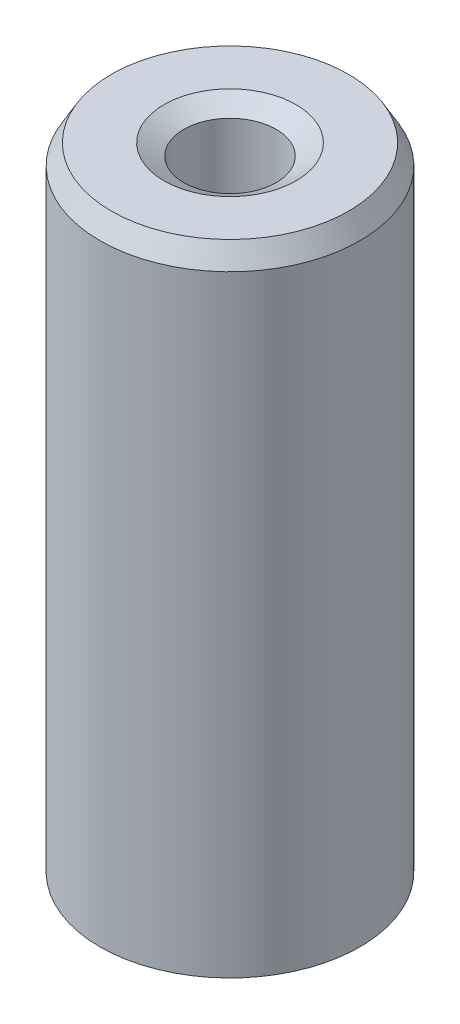
ISO-10303-21;
HEADER;
FILE_DESCRIPTION(('STEP AP214'),'2;1');
FILE_NAME('part.step','',(''),(''),'','','');
FILE_SCHEMA(('AUTOMOTIVE_DESIGN { 1 0 10303 214 1 1 1 1 }'));
ENDSEC;
DATA;
#1=APPLICATION_CONTEXT('core data for automotive mechanical design processes');
#2=APPLICATION_PROTOCOL_DEFINITION('international standard','automotive_design',2000,#1);
#3=PRODUCT_CONTEXT('',#1,'mechanical');
#4=PRODUCT('Part','Part','',(#3));
#5=PRODUCT_RELATED_PRODUCT_CATEGORY('part','',(#4));
#6=PRODUCT_DEFINITION_FORMATION('','',#4);
#7=PRODUCT_DEFINITION_CONTEXT('part definition',#1,'design');
#8=PRODUCT_DEFINITION('design','',#6,#7);
#9=PRODUCT_DEFINITION_SHAPE('','',#8);
#10=(LENGTH_UNIT() NAMED_UNIT(*) SI_UNIT(.MILLI.,.METRE.));
#11=(NAMED_UNIT(*) PLANE_ANGLE_UNIT() SI_UNIT($,.RADIAN.));
#12=(NAMED_UNIT(*) SI_UNIT($,.STERADIAN.) SOLID_ANGLE_UNIT());
#13=UNCERTAINTY_MEASURE_WITH_UNIT(LENGTH_MEASURE(1.E-05),#10,'distance_accuracy_value','');
#14=(GEOMETRIC_REPRESENTATION_CONTEXT(3) GLOBAL_UNCERTAINTY_ASSIGNED_CONTEXT((#13)) GLOBAL_UNIT_ASSIGNED_CONTEXT((#10,
#11,#12)) REPRESENTATION_CONTEXT('',''));
#15=CARTESIAN_POINT('',(0.,0.,0.));
#16=DIRECTION('',(0.,0.,1.));
#17=DIRECTION('',(1.,0.,0.));
#18=AXIS2_PLACEMENT_3D('',#15,#16,#17);
#19=CARTESIAN_POINT('',(0.,61.8129175879378,0.));
#20=DIRECTION('',(0.,-1.,0.));
#21=DIRECTION('',(0.,0.,-1.));
#22=AXIS2_PLACEMENT_3D('',#19,#20,#21);
#23=CYLINDRICAL_SURFACE('',#22,12.5);
#24=CARTESIAN_POINT('',(0.,1.10217291135548,0.));
#25=DIRECTION('',(0.,1.,0.));
#26=DIRECTION('',(0.,0.,1.));
#27=AXIS2_PLACEMENT_3D('',#24,#25,#26);
#28=CIRCLE('',#27,12.5);
#29=CARTESIAN_POINT('',(0.,1.10217291135548,12.5));
#30=VERTEX_POINT('',#29);
#31=EDGE_CURVE('E10',#30,#30,#28,.T.);
#32=ORIENTED_EDGE('',*,*,#31,.T.);
#33=EDGE_LOOP('',(#32));
#34=FACE_BOUND('',#33,.T.);
#35=CARTESIAN_POINT('',(0.,59.9044467498225,0.));
#36=DIRECTION('',(0.,1.,0.));
#37=DIRECTION('',(0.,0.,1.));
#38=AXIS2_PLACEMENT_3D('',#35,#36,#37);
#39=CIRCLE('',#38,12.5);
#40=CARTESIAN_POINT('',(0.,59.9044467498225,12.5));
#41=VERTEX_POINT('',#40);
#42=EDGE_CURVE('E50',#41,#41,#39,.F.);
#43=ORIENTED_EDGE('',*,*,#42,.T.);
#44=EDGE_LOOP('',(#43));
#45=FACE_BOUND('',#44,.T.);
#46=ADVANCED_FACE('F39',(#34,#45),#23,.T.);
#47=CARTESIAN_POINT('',(0.,61.8129175879378,0.));
#48=DIRECTION('',(0.,1.,0.));
#49=DIRECTION('',(0.,0.,1.));
#50=AXIS2_PLACEMENT_3D('',#47,#48,#49);
#51=PLANE('',#50);
#52=CARTESIAN_POINT('',(0.,61.8129175879378,0.));
#53=DIRECTION('',(0.,1.,0.));
#54=DIRECTION('',(0.,0.,1.));
#55=AXIS2_PLACEMENT_3D('',#52,#53,#54);
#56=CIRCLE('',#55,6.34905784751202);
#57=CARTESIAN_POINT('',(0.,61.8129175879378,6.34905784751202));
#58=VERTEX_POINT('',#57);
#59=EDGE_CURVE('E58',#58,#58,#56,.F.);
#60=ORIENTED_EDGE('',*,*,#59,.T.);
#61=EDGE_LOOP('',(#60));
#62=FACE_BOUND('',#61,.T.);
#63=CARTESIAN_POINT('',(0.,61.8129175879378,0.));
#64=DIRECTION('',(0.,1.,0.));
#65=DIRECTION('',(0.,0.,1.));
#66=AXIS2_PLACEMENT_3D('',#63,#64,#65);
#67=CIRCLE('',#66,11.3978270886445);
#68=CARTESIAN_POINT('',(0.,61.8129175879378,11.3978270886445));
#69=VERTEX_POINT('',#68);
#70=EDGE_CURVE('E61',#69,#69,#67,.T.);
#71=ORIENTED_EDGE('',*,*,#70,.T.);
#72=EDGE_LOOP('',(#71));
#73=FACE_BOUND('',#72,.T.);
#74=ADVANCED_FACE('F88',(#62,#73),#51,.T.);
#75=CARTESIAN_POINT('',(0.,0.,0.));
#76=DIRECTION('',(0.,1.,0.));
#77=DIRECTION('',(0.,0.,1.));
#78=AXIS2_PLACEMENT_3D('',#75,#76,#77);
#79=PLANE('',#78);
#80=CARTESIAN_POINT('',(0.,0.,0.));
#81=DIRECTION('',(0.,1.,0.));
#82=DIRECTION('',(0.,0.,1.));
#83=AXIS2_PLACEMENT_3D('',#80,#81,#82);
#84=CIRCLE('',#83,5.54275992075214);
#85=CARTESIAN_POINT('',(0.,0.,5.54275992075214));
#86=VERTEX_POINT('',#85);
#87=EDGE_CURVE('E51',#86,#86,#84,.T.);
#88=ORIENTED_EDGE('',*,*,#87,.T.);
#89=EDGE_LOOP('',(#88));
#90=FACE_BOUND('',#89,.T.);
#91=CARTESIAN_POINT('',(0.,0.,0.));
#92=DIRECTION('',(0.,1.,0.));
#93=DIRECTION('',(0.,0.,1.));
#94=AXIS2_PLACEMENT_3D('',#91,#92,#93);
#95=CIRCLE('',#94,10.5915291618847);
#96=CARTESIAN_POINT('',(0.,0.,10.5915291618847));
#97=VERTEX_POINT('',#96);
#98=EDGE_CURVE('E54',#97,#97,#95,.F.);
#99=ORIENTED_EDGE('',*,*,#98,.T.);
#100=EDGE_LOOP('',(#99));
#101=FACE_BOUND('',#100,.T.);
#102=ADVANCED_FACE('F83',(#90,#101),#79,.F.);
#103=CARTESIAN_POINT('',(0.,61.8129175879378,0.));
#104=DIRECTION('',(0.,-1.,0.));
#105=DIRECTION('',(0.,0.,-1.));
#106=AXIS2_PLACEMENT_3D('',#103,#104,#105);
#107=CYLINDRICAL_SURFACE('',#106,4.44058700939667);
#108=CARTESIAN_POINT('',(0.,60.7107446765823,0.));
#109=DIRECTION('',(0.,1.,0.));
#110=DIRECTION('',(0.,0.,1.));
#111=AXIS2_PLACEMENT_3D('',#108,#109,#110);
#112=CIRCLE('',#111,4.44058700939667);
#113=CARTESIAN_POINT('',(0.,60.7107446765823,4.44058700939667));
#114=VERTEX_POINT('',#113);
#115=EDGE_CURVE('E67',#114,#114,#112,.T.);
#116=ORIENTED_EDGE('',*,*,#115,.T.);
#117=EDGE_LOOP('',(#116));
#118=FACE_BOUND('',#117,.T.);
#119=CARTESIAN_POINT('',(0.,1.90847083811532,0.));
#120=DIRECTION('',(0.,1.,0.));
#121=DIRECTION('',(0.,0.,1.));
#122=AXIS2_PLACEMENT_3D('',#119,#120,#121);
#123=CIRCLE('',#122,4.44058700939667);
#124=CARTESIAN_POINT('',(0.,1.90847083811532,4.44058700939667));
#125=VERTEX_POINT('',#124);
#126=EDGE_CURVE('E69',#125,#125,#123,.F.);
#127=ORIENTED_EDGE('',*,*,#126,.T.);
#128=EDGE_LOOP('',(#127));
#129=FACE_BOUND('',#128,.T.);
#130=ADVANCED_FACE('F71',(#118,#129),#107,.F.);
#131=CARTESIAN_POINT('',(0.,60.7107446765823,0.));
#132=DIRECTION('',(0.,1.,0.));
#133=DIRECTION('',(0.,0.,1.));
#134=AXIS2_PLACEMENT_3D('',#131,#132,#133);
#135=CONICAL_SURFACE('',#134,4.44058700939667,1.04707307858583);
#136=ORIENTED_EDGE('',*,*,#59,.F.);
#137=EDGE_LOOP('',(#136));
#138=FACE_BOUND('',#137,.T.);
#139=ORIENTED_EDGE('',*,*,#115,.F.);
#140=EDGE_LOOP('',(#139));
#141=FACE_BOUND('',#140,.T.);
#142=ADVANCED_FACE('F77',(#138,#141),#135,.F.);
#143=CARTESIAN_POINT('',(0.,0.,0.));
#144=DIRECTION('',(0.,-1.,0.));
#145=DIRECTION('',(0.,0.,-1.));
#146=AXIS2_PLACEMENT_3D('',#143,#144,#145);
#147=CONICAL_SURFACE('',#146,5.54275992075214,0.523723248209067);
#148=ORIENTED_EDGE('',*,*,#126,.F.);
#149=EDGE_LOOP('',(#148));
#150=FACE_BOUND('',#149,.T.);
#151=ORIENTED_EDGE('',*,*,#87,.F.);
#152=EDGE_LOOP('',(#151));
#153=FACE_BOUND('',#152,.T.);
#154=ADVANCED_FACE('F73',(#150,#153),#147,.F.);
#155=CARTESIAN_POINT('',(0.,1.10217291135548,0.));
#156=DIRECTION('',(0.,1.,0.));
#157=DIRECTION('',(0.,0.,1.));
#158=AXIS2_PLACEMENT_3D('',#155,#156,#157);
#159=CONICAL_SURFACE('',#158,12.5,1.04707307858583);
#160=ORIENTED_EDGE('',*,*,#98,.F.);
#161=EDGE_LOOP('',(#160));
#162=FACE_BOUND('',#161,.T.);
#163=ORIENTED_EDGE('',*,*,#31,.F.);
#164=EDGE_LOOP('',(#163));
#165=FACE_BOUND('',#164,.T.);
#166=ADVANCED_FACE('F76',(#162,#165),#159,.T.);
#167=CARTESIAN_POINT('',(0.,61.8129175879378,0.));
#168=DIRECTION('',(0.,-1.,0.));
#169=DIRECTION('',(0.,0.,-1.));
#170=AXIS2_PLACEMENT_3D('',#167,#168,#169);
#171=CONICAL_SURFACE('',#170,11.3978270886445,0.523723248209066);
#172=ORIENTED_EDGE('',*,*,#42,.F.);
#173=EDGE_LOOP('',(#172));
#174=FACE_BOUND('',#173,.T.);
#175=ORIENTED_EDGE('',*,*,#70,.F.);
#176=EDGE_LOOP('',(#175));
#177=FACE_BOUND('',#176,.T.);
#178=ADVANCED_FACE('F45',(#174,#177),#171,.T.);
#179=CLOSED_SHELL('',(#46,#74,#102,#130,#142,#154,#166,#178));
#180=MANIFOLD_SOLID_BREP('B2',#179);
#181=ADVANCED_BREP_SHAPE_REPRESENTATION('',(#18,#180),#14);
#182=SHAPE_DEFINITION_REPRESENTATION(#9,#181);
ENDSEC;
END-ISO-10303-21;
